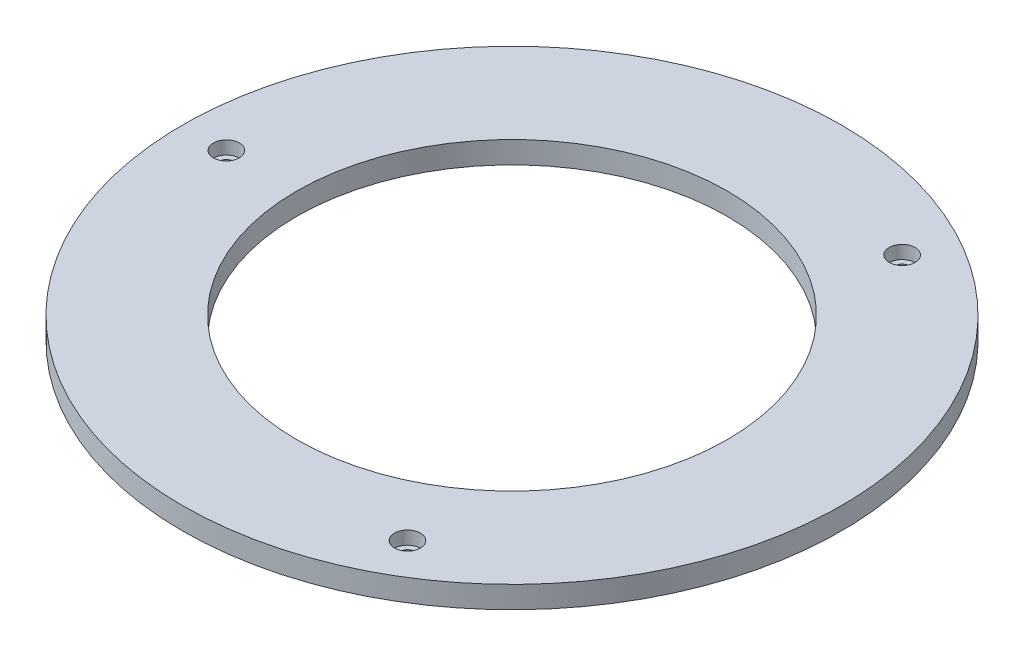
ISO-10303-21;
HEADER;
FILE_DESCRIPTION(('STEP AP214'),'2;1');
FILE_NAME('part.step','',(''),(''),'','','');
FILE_SCHEMA(('AUTOMOTIVE_DESIGN { 1 0 10303 214 1 1 1 1 }'));
ENDSEC;
DATA;
#1=APPLICATION_CONTEXT('core data for automotive mechanical design processes');
#2=APPLICATION_PROTOCOL_DEFINITION('international standard','automotive_design',2000,#1);
#3=PRODUCT_CONTEXT('',#1,'mechanical');
#4=PRODUCT('Part','Part','',(#3));
#5=PRODUCT_RELATED_PRODUCT_CATEGORY('part','',(#4));
#6=PRODUCT_DEFINITION_FORMATION('','',#4);
#7=PRODUCT_DEFINITION_CONTEXT('part definition',#1,'design');
#8=PRODUCT_DEFINITION('design','',#6,#7);
#9=PRODUCT_DEFINITION_SHAPE('','',#8);
#10=(LENGTH_UNIT() NAMED_UNIT(*) SI_UNIT(.MILLI.,.METRE.));
#11=(NAMED_UNIT(*) PLANE_ANGLE_UNIT() SI_UNIT($,.RADIAN.));
#12=(NAMED_UNIT(*) SI_UNIT($,.STERADIAN.) SOLID_ANGLE_UNIT());
#13=UNCERTAINTY_MEASURE_WITH_UNIT(LENGTH_MEASURE(1.E-05),#10,'distance_accuracy_value','');
#14=(GEOMETRIC_REPRESENTATION_CONTEXT(3) GLOBAL_UNCERTAINTY_ASSIGNED_CONTEXT((#13)) GLOBAL_UNIT_ASSIGNED_CONTEXT((#10,
#11,#12)) REPRESENTATION_CONTEXT('',''));
#15=CARTESIAN_POINT('',(0.,0.,0.));
#16=DIRECTION('',(0.,0.,1.));
#17=DIRECTION('',(1.,0.,0.));
#18=AXIS2_PLACEMENT_3D('',#15,#16,#17);
#19=CARTESIAN_POINT('',(32.4999999999995,0.,-56.2916512459888));
#20=DIRECTION('',(0.,1.,0.));
#21=DIRECTION('',(0.,0.,1.));
#22=AXIS2_PLACEMENT_3D('',#19,#20,#21);
#23=CYLINDRICAL_SURFACE('',#22,1.7);
#24=CARTESIAN_POINT('',(32.4999999999995,0.,-56.2916512459888));
#25=DIRECTION('',(0.,1.,0.));
#26=DIRECTION('',(-0.866025403784443,0.,-0.499999999999992));
#27=AXIS2_PLACEMENT_3D('',#24,#25,#26);
#28=CIRCLE('',#27,1.7);
#29=CARTESIAN_POINT('',(31.0277568135659,0.,-57.1416512459888));
#30=VERTEX_POINT('',#29);
#31=EDGE_CURVE('E63',#30,#30,#28,.T.);
#32=ORIENTED_EDGE('',*,*,#31,.F.);
#33=EDGE_LOOP('',(#32));
#34=FACE_BOUND('',#33,.T.);
#35=CARTESIAN_POINT('',(32.4999999999995,2.,-56.2916512459888));
#36=DIRECTION('',(0.,1.,0.));
#37=DIRECTION('',(0.,0.,1.));
#38=AXIS2_PLACEMENT_3D('',#35,#36,#37);
#39=CIRCLE('',#38,1.7);
#40=CARTESIAN_POINT('',(32.4999999999995,2.,-54.5916512459888));
#41=VERTEX_POINT('',#40);
#42=EDGE_CURVE('E38',#41,#41,#39,.F.);
#43=ORIENTED_EDGE('',*,*,#42,.F.);
#44=EDGE_LOOP('',(#43));
#45=FACE_BOUND('',#44,.T.);
#46=ADVANCED_FACE('F34',(#34,#45),#23,.F.);
#47=CARTESIAN_POINT('',(32.5000000000003,0.,56.2916512459884));
#48=DIRECTION('',(0.,1.,0.));
#49=DIRECTION('',(0.,0.,1.));
#50=AXIS2_PLACEMENT_3D('',#47,#48,#49);
#51=CYLINDRICAL_SURFACE('',#50,1.7);
#52=CARTESIAN_POINT('',(32.5000000000003,0.,56.2916512459884));
#53=DIRECTION('',(0.,1.,0.));
#54=DIRECTION('',(0.866025403784436,0.,-0.500000000000004));
#55=AXIS2_PLACEMENT_3D('',#52,#53,#54);
#56=CIRCLE('',#55,1.7);
#57=CARTESIAN_POINT('',(33.9722431864338,0.,55.4416512459884));
#58=VERTEX_POINT('',#57);
#59=EDGE_CURVE('E78',#58,#58,#56,.T.);
#60=ORIENTED_EDGE('',*,*,#59,.F.);
#61=EDGE_LOOP('',(#60));
#62=FACE_BOUND('',#61,.T.);
#63=CARTESIAN_POINT('',(32.5000000000003,2.,56.2916512459884));
#64=DIRECTION('',(0.,1.,0.));
#65=DIRECTION('',(0.,0.,1.));
#66=AXIS2_PLACEMENT_3D('',#63,#64,#65);
#67=CIRCLE('',#66,1.7);
#68=CARTESIAN_POINT('',(32.5000000000003,2.,57.9916512459884));
#69=VERTEX_POINT('',#68);
#70=EDGE_CURVE('E57',#69,#69,#67,.F.);
#71=ORIENTED_EDGE('',*,*,#70,.F.);
#72=EDGE_LOOP('',(#71));
#73=FACE_BOUND('',#72,.T.);
#74=ADVANCED_FACE('F112',(#62,#73),#51,.F.);
#75=CARTESIAN_POINT('',(-65.,0.,0.));
#76=DIRECTION('',(0.,1.,0.));
#77=DIRECTION('',(0.,0.,1.));
#78=AXIS2_PLACEMENT_3D('',#75,#76,#77);
#79=CYLINDRICAL_SURFACE('',#78,1.7);
#80=CARTESIAN_POINT('',(-65.,0.,0.));
#81=DIRECTION('',(0.,1.,0.));
#82=DIRECTION('',(0.,0.,1.));
#83=AXIS2_PLACEMENT_3D('',#80,#81,#82);
#84=CIRCLE('',#83,1.7);
#85=CARTESIAN_POINT('',(-65.,0.,1.7));
#86=VERTEX_POINT('',#85);
#87=EDGE_CURVE('E55',#86,#86,#84,.T.);
#88=ORIENTED_EDGE('',*,*,#87,.F.);
#89=EDGE_LOOP('',(#88));
#90=FACE_BOUND('',#89,.T.);
#91=CARTESIAN_POINT('',(-65.,2.,0.));
#92=DIRECTION('',(0.,1.,0.));
#93=DIRECTION('',(0.,0.,1.));
#94=AXIS2_PLACEMENT_3D('',#91,#92,#93);
#95=CIRCLE('',#94,1.7);
#96=CARTESIAN_POINT('',(-65.,2.,1.7));
#97=VERTEX_POINT('',#96);
#98=EDGE_CURVE('E53',#97,#97,#95,.F.);
#99=ORIENTED_EDGE('',*,*,#98,.F.);
#100=EDGE_LOOP('',(#99));
#101=FACE_BOUND('',#100,.T.);
#102=ADVANCED_FACE('F118',(#90,#101),#79,.F.);
#103=CARTESIAN_POINT('',(0.,5.,0.));
#104=DIRECTION('',(0.,1.,0.));
#105=DIRECTION('',(0.,0.,1.));
#106=AXIS2_PLACEMENT_3D('',#103,#104,#105);
#107=PLANE('',#106);
#108=CARTESIAN_POINT('',(32.5000000000003,5.,56.2916512459884));
#109=DIRECTION('',(0.,1.,0.));
#110=DIRECTION('',(0.866025403784436,0.,-0.500000000000004));
#111=AXIS2_PLACEMENT_3D('',#108,#109,#110);
#112=CIRCLE('',#111,2.95);
#113=CARTESIAN_POINT('',(35.0547749411644,5.,54.8166512459884));
#114=VERTEX_POINT('',#113);
#115=EDGE_CURVE('E65',#114,#114,#112,.T.);
#116=ORIENTED_EDGE('',*,*,#115,.F.);
#117=EDGE_LOOP('',(#116));
#118=FACE_BOUND('',#117,.T.);
#119=CARTESIAN_POINT('',(32.4999999999995,5.,-56.2916512459888));
#120=DIRECTION('',(0.,1.,0.));
#121=DIRECTION('',(-0.866025403784443,0.,-0.499999999999992));
#122=AXIS2_PLACEMENT_3D('',#119,#120,#121);
#123=CIRCLE('',#122,2.95);
#124=CARTESIAN_POINT('',(29.9452250588354,5.,-57.7666512459888));
#125=VERTEX_POINT('',#124);
#126=EDGE_CURVE('E75',#125,#125,#123,.T.);
#127=ORIENTED_EDGE('',*,*,#126,.F.);
#128=EDGE_LOOP('',(#127));
#129=FACE_BOUND('',#128,.T.);
#130=CARTESIAN_POINT('',(-65.,5.,0.));
#131=DIRECTION('',(0.,1.,0.));
#132=DIRECTION('',(0.,0.,1.));
#133=AXIS2_PLACEMENT_3D('',#130,#131,#132);
#134=CIRCLE('',#133,2.95);
#135=CARTESIAN_POINT('',(-65.,5.,2.95));
#136=VERTEX_POINT('',#135);
#137=EDGE_CURVE('E81',#136,#136,#134,.T.);
#138=ORIENTED_EDGE('',*,*,#137,.F.);
#139=EDGE_LOOP('',(#138));
#140=FACE_BOUND('',#139,.T.);
#141=CARTESIAN_POINT('',(0.,5.,0.));
#142=DIRECTION('',(0.,1.,0.));
#143=DIRECTION('',(0.,0.,1.));
#144=AXIS2_PLACEMENT_3D('',#141,#142,#143);
#145=CIRCLE('',#144,75.);
#146=CARTESIAN_POINT('',(0.,5.,75.));
#147=VERTEX_POINT('',#146);
#148=EDGE_CURVE('E10',#147,#147,#145,.T.);
#149=ORIENTED_EDGE('',*,*,#148,.T.);
#150=EDGE_LOOP('',(#149));
#151=FACE_BOUND('',#150,.T.);
#152=CARTESIAN_POINT('',(0.,5.,0.));
#153=DIRECTION('',(0.,1.,0.));
#154=DIRECTION('',(0.,0.,1.));
#155=AXIS2_PLACEMENT_3D('',#152,#153,#154);
#156=CIRCLE('',#155,49.);
#157=CARTESIAN_POINT('',(0.,5.,49.));
#158=VERTEX_POINT('',#157);
#159=EDGE_CURVE('E47',#158,#158,#156,.T.);
#160=ORIENTED_EDGE('',*,*,#159,.F.);
#161=EDGE_LOOP('',(#160));
#162=FACE_BOUND('',#161,.T.);
#163=ADVANCED_FACE('F129',(#118,#129,#140,#151,#162),#107,.T.);
#164=CARTESIAN_POINT('',(0.,0.,0.));
#165=DIRECTION('',(0.,1.,0.));
#166=DIRECTION('',(0.,0.,1.));
#167=AXIS2_PLACEMENT_3D('',#164,#165,#166);
#168=PLANE('',#167);
#169=ORIENTED_EDGE('',*,*,#59,.T.);
#170=EDGE_LOOP('',(#169));
#171=FACE_BOUND('',#170,.T.);
#172=ORIENTED_EDGE('',*,*,#31,.T.);
#173=EDGE_LOOP('',(#172));
#174=FACE_BOUND('',#173,.T.);
#175=ORIENTED_EDGE('',*,*,#87,.T.);
#176=EDGE_LOOP('',(#175));
#177=FACE_BOUND('',#176,.T.);
#178=CARTESIAN_POINT('',(0.,0.,0.));
#179=DIRECTION('',(0.,1.,0.));
#180=DIRECTION('',(0.,0.,1.));
#181=AXIS2_PLACEMENT_3D('',#178,#179,#180);
#182=CIRCLE('',#181,75.);
#183=CARTESIAN_POINT('',(0.,0.,75.));
#184=VERTEX_POINT('',#183);
#185=EDGE_CURVE('E42',#184,#184,#182,.T.);
#186=ORIENTED_EDGE('',*,*,#185,.F.);
#187=EDGE_LOOP('',(#186));
#188=FACE_BOUND('',#187,.T.);
#189=CARTESIAN_POINT('',(0.,0.,0.));
#190=DIRECTION('',(0.,1.,0.));
#191=DIRECTION('',(0.,0.,1.));
#192=AXIS2_PLACEMENT_3D('',#189,#190,#191);
#193=CIRCLE('',#192,49.);
#194=CARTESIAN_POINT('',(0.,0.,49.));
#195=VERTEX_POINT('',#194);
#196=EDGE_CURVE('E50',#195,#195,#193,.T.);
#197=ORIENTED_EDGE('',*,*,#196,.T.);
#198=EDGE_LOOP('',(#197));
#199=FACE_BOUND('',#198,.T.);
#200=ADVANCED_FACE('F95',(#171,#174,#177,#188,#199),#168,.F.);
#201=CARTESIAN_POINT('',(0.,5.,0.));
#202=DIRECTION('',(0.,-1.,0.));
#203=DIRECTION('',(0.,0.,-1.));
#204=AXIS2_PLACEMENT_3D('',#201,#202,#203);
#205=CYLINDRICAL_SURFACE('',#204,75.);
#206=ORIENTED_EDGE('',*,*,#148,.F.);
#207=EDGE_LOOP('',(#206));
#208=FACE_BOUND('',#207,.T.);
#209=ORIENTED_EDGE('',*,*,#185,.T.);
#210=EDGE_LOOP('',(#209));
#211=FACE_BOUND('',#210,.T.);
#212=ADVANCED_FACE('F36',(#208,#211),#205,.T.);
#213=CARTESIAN_POINT('',(0.,5.,0.));
#214=DIRECTION('',(0.,-1.,0.));
#215=DIRECTION('',(0.,0.,-1.));
#216=AXIS2_PLACEMENT_3D('',#213,#214,#215);
#217=CYLINDRICAL_SURFACE('',#216,49.);
#218=ORIENTED_EDGE('',*,*,#159,.T.);
#219=EDGE_LOOP('',(#218));
#220=FACE_BOUND('',#219,.T.);
#221=ORIENTED_EDGE('',*,*,#196,.F.);
#222=EDGE_LOOP('',(#221));
#223=FACE_BOUND('',#222,.T.);
#224=ADVANCED_FACE('F97',(#220,#223),#217,.F.);
#225=CARTESIAN_POINT('',(-65.,2.,0.));
#226=DIRECTION('',(0.,1.,0.));
#227=DIRECTION('',(0.,0.,1.));
#228=AXIS2_PLACEMENT_3D('',#225,#226,#227);
#229=PLANE('',#228);
#230=CARTESIAN_POINT('',(-65.,2.,0.));
#231=DIRECTION('',(0.,1.,0.));
#232=DIRECTION('',(0.,0.,1.));
#233=AXIS2_PLACEMENT_3D('',#230,#231,#232);
#234=CIRCLE('',#233,2.95);
#235=CARTESIAN_POINT('',(-65.,2.,2.95));
#236=VERTEX_POINT('',#235);
#237=EDGE_CURVE('E56',#236,#236,#234,.T.);
#238=ORIENTED_EDGE('',*,*,#237,.T.);
#239=EDGE_LOOP('',(#238));
#240=FACE_BOUND('',#239,.T.);
#241=ORIENTED_EDGE('',*,*,#98,.T.);
#242=EDGE_LOOP('',(#241));
#243=FACE_BOUND('',#242,.T.);
#244=ADVANCED_FACE('F99',(#240,#243),#229,.T.);
#245=CARTESIAN_POINT('',(-65.,2.,0.));
#246=DIRECTION('',(0.,1.,0.));
#247=DIRECTION('',(0.,0.,1.));
#248=AXIS2_PLACEMENT_3D('',#245,#246,#247);
#249=CYLINDRICAL_SURFACE('',#248,2.95);
#250=ORIENTED_EDGE('',*,*,#237,.F.);
#251=EDGE_LOOP('',(#250));
#252=FACE_BOUND('',#251,.T.);
#253=ORIENTED_EDGE('',*,*,#137,.T.);
#254=EDGE_LOOP('',(#253));
#255=FACE_BOUND('',#254,.T.);
#256=ADVANCED_FACE('F105',(#252,#255),#249,.F.);
#257=CARTESIAN_POINT('',(32.5000000000003,2.,56.2916512459884));
#258=DIRECTION('',(0.,1.,0.));
#259=DIRECTION('',(0.866025403784436,0.,-0.500000000000004));
#260=AXIS2_PLACEMENT_3D('',#257,#258,#259);
#261=PLANE('',#260);
#262=CARTESIAN_POINT('',(32.5000000000003,2.,56.2916512459884));
#263=DIRECTION('',(0.,1.,0.));
#264=DIRECTION('',(0.866025403784436,0.,-0.500000000000004));
#265=AXIS2_PLACEMENT_3D('',#262,#263,#264);
#266=CIRCLE('',#265,2.95);
#267=CARTESIAN_POINT('',(35.0547749411644,2.,54.8166512459884));
#268=VERTEX_POINT('',#267);
#269=EDGE_CURVE('E59',#268,#268,#266,.T.);
#270=ORIENTED_EDGE('',*,*,#269,.T.);
#271=EDGE_LOOP('',(#270));
#272=FACE_BOUND('',#271,.T.);
#273=ORIENTED_EDGE('',*,*,#70,.T.);
#274=EDGE_LOOP('',(#273));
#275=FACE_BOUND('',#274,.T.);
#276=ADVANCED_FACE('F126',(#272,#275),#261,.T.);
#277=CARTESIAN_POINT('',(32.5000000000003,2.,56.2916512459884));
#278=DIRECTION('',(0.,1.,0.));
#279=DIRECTION('',(0.,0.,1.));
#280=AXIS2_PLACEMENT_3D('',#277,#278,#279);
#281=CYLINDRICAL_SURFACE('',#280,2.95);
#282=ORIENTED_EDGE('',*,*,#269,.F.);
#283=EDGE_LOOP('',(#282));
#284=FACE_BOUND('',#283,.T.);
#285=ORIENTED_EDGE('',*,*,#115,.T.);
#286=EDGE_LOOP('',(#285));
#287=FACE_BOUND('',#286,.T.);
#288=ADVANCED_FACE('F202',(#284,#287),#281,.F.);
#289=CARTESIAN_POINT('',(32.4999999999995,2.,-56.2916512459888));
#290=DIRECTION('',(0.,1.,0.));
#291=DIRECTION('',(-0.866025403784443,0.,-0.499999999999992));
#292=AXIS2_PLACEMENT_3D('',#289,#290,#291);
#293=PLANE('',#292);
#294=CARTESIAN_POINT('',(32.4999999999995,2.,-56.2916512459888));
#295=DIRECTION('',(0.,1.,0.));
#296=DIRECTION('',(-0.866025403784443,0.,-0.499999999999992));
#297=AXIS2_PLACEMENT_3D('',#294,#295,#296);
#298=CIRCLE('',#297,2.95);
#299=CARTESIAN_POINT('',(29.9452250588354,2.,-57.7666512459888));
#300=VERTEX_POINT('',#299);
#301=EDGE_CURVE('E70',#300,#300,#298,.T.);
#302=ORIENTED_EDGE('',*,*,#301,.T.);
#303=EDGE_LOOP('',(#302));
#304=FACE_BOUND('',#303,.T.);
#305=ORIENTED_EDGE('',*,*,#42,.T.);
#306=EDGE_LOOP('',(#305));
#307=FACE_BOUND('',#306,.T.);
#308=ADVANCED_FACE('F210',(#304,#307),#293,.T.);
#309=CARTESIAN_POINT('',(32.4999999999995,2.,-56.2916512459888));
#310=DIRECTION('',(0.,1.,0.));
#311=DIRECTION('',(0.,0.,1.));
#312=AXIS2_PLACEMENT_3D('',#309,#310,#311);
#313=CYLINDRICAL_SURFACE('',#312,2.95);
#314=ORIENTED_EDGE('',*,*,#301,.F.);
#315=EDGE_LOOP('',(#314));
#316=FACE_BOUND('',#315,.T.);
#317=ORIENTED_EDGE('',*,*,#126,.T.);
#318=EDGE_LOOP('',(#317));
#319=FACE_BOUND('',#318,.T.);
#320=ADVANCED_FACE('F219',(#316,#319),#313,.F.);
#321=CLOSED_SHELL('',(#46,#74,#102,#163,#200,#212,#224,#244,#256,#276,#288,#308,#320));
#322=MANIFOLD_SOLID_BREP('B2',#321);
#323=ADVANCED_BREP_SHAPE_REPRESENTATION('',(#18,#322),#14);
#324=SHAPE_DEFINITION_REPRESENTATION(#9,#323);
ENDSEC;
END-ISO-10303-21;
